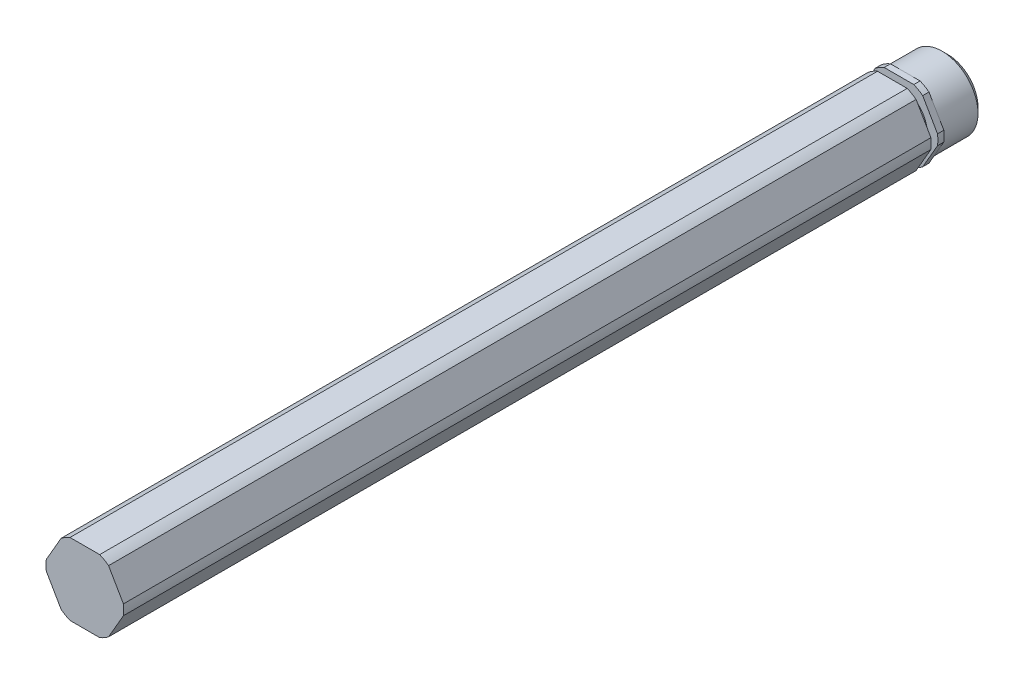
ISO-10303-21;
HEADER;
FILE_DESCRIPTION(('STEP AP214'),'2;1');
FILE_NAME('part.step','',(''),(''),'','','');
FILE_SCHEMA(('AUTOMOTIVE_DESIGN { 1 0 10303 214 1 1 1 1 }'));
ENDSEC;
DATA;
#1=APPLICATION_CONTEXT('core data for automotive mechanical design processes');
#2=APPLICATION_PROTOCOL_DEFINITION('international standard','automotive_design',2000,#1);
#3=PRODUCT_CONTEXT('',#1,'mechanical');
#4=PRODUCT('Part','Part','',(#3));
#5=PRODUCT_RELATED_PRODUCT_CATEGORY('part','',(#4));
#6=PRODUCT_DEFINITION_FORMATION('','',#4);
#7=PRODUCT_DEFINITION_CONTEXT('part definition',#1,'design');
#8=PRODUCT_DEFINITION('design','',#6,#7);
#9=PRODUCT_DEFINITION_SHAPE('','',#8);
#10=(LENGTH_UNIT() NAMED_UNIT(*) SI_UNIT(.MILLI.,.METRE.));
#11=(NAMED_UNIT(*) PLANE_ANGLE_UNIT() SI_UNIT($,.RADIAN.));
#12=(NAMED_UNIT(*) SI_UNIT($,.STERADIAN.) SOLID_ANGLE_UNIT());
#13=UNCERTAINTY_MEASURE_WITH_UNIT(LENGTH_MEASURE(1.E-05),#10,'distance_accuracy_value','');
#14=(GEOMETRIC_REPRESENTATION_CONTEXT(3) GLOBAL_UNCERTAINTY_ASSIGNED_CONTEXT((#13)) GLOBAL_UNIT_ASSIGNED_CONTEXT((#10,
#11,#12)) REPRESENTATION_CONTEXT('',''));
#15=CARTESIAN_POINT('',(0.,0.,0.));
#16=DIRECTION('',(0.,0.,1.));
#17=DIRECTION('',(1.,0.,0.));
#18=AXIS2_PLACEMENT_3D('',#15,#16,#17);
#19=CARTESIAN_POINT('',(7.33234841870824,0.,-76.2));
#20=DIRECTION('',(0.,0.,1.));
#21=DIRECTION('',(1.,0.,0.));
#22=AXIS2_PLACEMENT_3D('',#19,#20,#21);
#23=PLANE('',#22);
#24=CARTESIAN_POINT('',(0.,0.,-76.1999999999716));
#25=DIRECTION('',(0.,0.,1.));
#26=DIRECTION('',(1.,0.,0.));
#27=AXIS2_PLACEMENT_3D('',#24,#25,#26);
#28=CIRCLE('',#27,5.35000000002128);
#29=CARTESIAN_POINT('',(5.35000000002128,0.,-76.1999999999716));
#30=VERTEX_POINT('',#29);
#31=EDGE_CURVE('E20',#30,#30,#28,.T.);
#32=ORIENTED_EDGE('',*,*,#31,.F.);
#33=EDGE_LOOP('',(#32));
#34=FACE_BOUND('',#33,.T.);
#35=ADVANCED_FACE('F17',(#34),#23,.F.);
#36=CARTESIAN_POINT('',(0.,0.,-75.1999999999953));
#37=DIRECTION('',(0.,0.,1.));
#38=DIRECTION('',(1.,0.,0.));
#39=AXIS2_PLACEMENT_3D('',#36,#37,#38);
#40=CONICAL_SURFACE('',#39,6.34999999999764,0.785398163397448);
#41=ORIENTED_EDGE('',*,*,#31,.T.);
#42=EDGE_LOOP('',(#41));
#43=FACE_BOUND('',#42,.T.);
#44=CARTESIAN_POINT('',(0.,0.,-75.2));
#45=DIRECTION('',(0.,0.,-1.));
#46=DIRECTION('',(-1.,0.,0.));
#47=AXIS2_PLACEMENT_3D('',#44,#45,#46);
#48=CIRCLE('',#47,6.35);
#49=CARTESIAN_POINT('',(-6.35,0.,-75.2));
#50=VERTEX_POINT('',#49);
#51=EDGE_CURVE('E216',#50,#50,#48,.F.);
#52=ORIENTED_EDGE('',*,*,#51,.F.);
#53=EDGE_LOOP('',(#52));
#54=FACE_BOUND('',#53,.T.);
#55=ADVANCED_FACE('F797',(#43,#54),#40,.T.);
#56=CARTESIAN_POINT('',(0.,0.,-68.704));
#57=DIRECTION('',(0.,0.,-1.));
#58=DIRECTION('',(-1.,0.,0.));
#59=AXIS2_PLACEMENT_3D('',#56,#57,#58);
#60=CYLINDRICAL_SURFACE('',#59,6.35);
#61=CARTESIAN_POINT('',(0.,0.,-68.704));
#62=DIRECTION('',(0.,0.,-1.));
#63=DIRECTION('',(-1.,0.,0.));
#64=AXIS2_PLACEMENT_3D('',#61,#62,#63);
#65=CIRCLE('',#64,6.35);
#66=CARTESIAN_POINT('',(5.49926131403119,-3.17499999999999,-68.704));
#67=VERTEX_POINT('',#66);
#68=CARTESIAN_POINT('',(5.49926131403118,3.17499999999999,-68.704));
#69=VERTEX_POINT('',#68);
#70=EDGE_CURVE('E191',#67,#69,#65,.F.);
#71=ORIENTED_EDGE('',*,*,#70,.F.);
#72=CARTESIAN_POINT('',(0.,0.,-68.704));
#73=DIRECTION('',(0.,0.,-1.));
#74=DIRECTION('',(-1.,0.,0.));
#75=AXIS2_PLACEMENT_3D('',#72,#73,#74);
#76=CIRCLE('',#75,6.35);
#77=CARTESIAN_POINT('',(0.,-6.35000000000002,-68.704));
#78=VERTEX_POINT('',#77);
#79=EDGE_CURVE('E202',#78,#67,#76,.F.);
#80=ORIENTED_EDGE('',*,*,#79,.F.);
#81=CARTESIAN_POINT('',(0.,0.,-68.704));
#82=DIRECTION('',(0.,0.,-1.));
#83=DIRECTION('',(-1.,0.,0.));
#84=AXIS2_PLACEMENT_3D('',#81,#82,#83);
#85=CIRCLE('',#84,6.35);
#86=CARTESIAN_POINT('',(-5.49926131403119,-3.17500000000001,-68.704));
#87=VERTEX_POINT('',#86);
#88=EDGE_CURVE('E321',#87,#78,#85,.F.);
#89=ORIENTED_EDGE('',*,*,#88,.F.);
#90=CARTESIAN_POINT('',(0.,0.,-68.704));
#91=DIRECTION('',(0.,0.,-1.));
#92=DIRECTION('',(-1.,0.,0.));
#93=AXIS2_PLACEMENT_3D('',#90,#91,#92);
#94=CIRCLE('',#93,6.35);
#95=CARTESIAN_POINT('',(-5.49926131403119,3.175,-68.704));
#96=VERTEX_POINT('',#95);
#97=EDGE_CURVE('E323',#96,#87,#94,.F.);
#98=ORIENTED_EDGE('',*,*,#97,.F.);
#99=CARTESIAN_POINT('',(0.,0.,-68.704));
#100=DIRECTION('',(0.,0.,-1.));
#101=DIRECTION('',(-1.,0.,0.));
#102=AXIS2_PLACEMENT_3D('',#99,#100,#101);
#103=CIRCLE('',#102,6.35);
#104=CARTESIAN_POINT('',(0.,6.35000000000001,-68.704));
#105=VERTEX_POINT('',#104);
#106=EDGE_CURVE('E211',#105,#96,#103,.F.);
#107=ORIENTED_EDGE('',*,*,#106,.F.);
#108=CARTESIAN_POINT('',(0.,0.,-68.704));
#109=DIRECTION('',(0.,0.,-1.));
#110=DIRECTION('',(-1.,0.,0.));
#111=AXIS2_PLACEMENT_3D('',#108,#109,#110);
#112=CIRCLE('',#111,6.35);
#113=EDGE_CURVE('E207',#69,#105,#112,.F.);
#114=ORIENTED_EDGE('',*,*,#113,.F.);
#115=EDGE_LOOP('',(#71,#80,#89,#98,#107,#114));
#116=FACE_BOUND('',#115,.T.);
#117=ORIENTED_EDGE('',*,*,#51,.T.);
#118=EDGE_LOOP('',(#117));
#119=FACE_BOUND('',#118,.T.);
#120=ADVANCED_FACE('F208',(#116,#119),#60,.T.);
#121=CARTESIAN_POINT('',(0.,0.,-68.704));
#122=DIRECTION('',(0.,0.,-1.));
#123=DIRECTION('',(-1.,0.,0.));
#124=AXIS2_PLACEMENT_3D('',#121,#122,#123);
#125=PLANE('',#124);
#126=DIRECTION('',(0.5,-0.866025403784439,0.));
#127=VECTOR('',#126,1.);
#128=CARTESIAN_POINT('',(7.33234841870824,0.,-68.704));
#129=LINE('',#128,#127);
#130=CARTESIAN_POINT('',(4.18830746282205,5.44563867667229,-68.704));
#131=VERTEX_POINT('',#130);
#132=EDGE_CURVE('E220',#131,#69,#129,.T.);
#133=ORIENTED_EDGE('',*,*,#132,.T.);
#134=ORIENTED_EDGE('',*,*,#113,.T.);
#135=DIRECTION('',(1.,0.,0.));
#136=VECTOR('',#135,1.);
#137=CARTESIAN_POINT('',(3.6661742093541,6.35000000000002,-68.704));
#138=LINE('',#137,#136);
#139=CARTESIAN_POINT('',(2.62190770241819,6.35000000000002,-68.704));
#140=VERTEX_POINT('',#139);
#141=EDGE_CURVE('E233',#105,#140,#138,.T.);
#142=ORIENTED_EDGE('',*,*,#141,.T.);
#143=CARTESIAN_POINT('',(0.,0.,-68.704));
#144=DIRECTION('',(0.,0.,1.));
#145=DIRECTION('',(1.,0.,0.));
#146=AXIS2_PLACEMENT_3D('',#143,#144,#145);
#147=CIRCLE('',#146,6.87);
#148=EDGE_CURVE('E228',#131,#140,#147,.T.);
#149=ORIENTED_EDGE('',*,*,#148,.F.);
#150=EDGE_LOOP('',(#133,#134,#142,#149));
#151=FACE_BOUND('',#150,.T.);
#152=ADVANCED_FACE('F227',(#151),#125,.T.);
#153=CARTESIAN_POINT('',(0.,0.,-68.704));
#154=DIRECTION('',(0.,0.,-1.));
#155=DIRECTION('',(-1.,0.,0.));
#156=AXIS2_PLACEMENT_3D('',#153,#154,#155);
#157=PLANE('',#156);
#158=DIRECTION('',(1.,0.,0.));
#159=VECTOR('',#158,1.);
#160=CARTESIAN_POINT('',(3.6661742093541,6.35000000000002,-68.704));
#161=LINE('',#160,#159);
#162=CARTESIAN_POINT('',(-2.62190770241819,6.35000000000002,-68.704));
#163=VERTEX_POINT('',#162);
#164=EDGE_CURVE('E318',#163,#105,#161,.T.);
#165=ORIENTED_EDGE('',*,*,#164,.T.);
#166=ORIENTED_EDGE('',*,*,#106,.T.);
#167=DIRECTION('',(0.5,0.866025403784439,0.));
#168=VECTOR('',#167,1.);
#169=CARTESIAN_POINT('',(-3.66617420935412,6.35000000000002,-68.704));
#170=LINE('',#169,#168);
#171=CARTESIAN_POINT('',(-4.18830746282208,5.44563867667226,-68.704));
#172=VERTEX_POINT('',#171);
#173=EDGE_CURVE('E331',#96,#172,#170,.T.);
#174=ORIENTED_EDGE('',*,*,#173,.T.);
#175=CARTESIAN_POINT('',(0.,0.,-68.704));
#176=DIRECTION('',(0.,0.,1.));
#177=DIRECTION('',(1.,0.,0.));
#178=AXIS2_PLACEMENT_3D('',#175,#176,#177);
#179=CIRCLE('',#178,6.87);
#180=EDGE_CURVE('E314',#163,#172,#179,.T.);
#181=ORIENTED_EDGE('',*,*,#180,.F.);
#182=EDGE_LOOP('',(#165,#166,#174,#181));
#183=FACE_BOUND('',#182,.T.);
#184=ADVANCED_FACE('F329',(#183),#157,.T.);
#185=CARTESIAN_POINT('',(0.,0.,-68.704));
#186=DIRECTION('',(0.,0.,-1.));
#187=DIRECTION('',(-1.,0.,0.));
#188=AXIS2_PLACEMENT_3D('',#185,#186,#187);
#189=PLANE('',#188);
#190=DIRECTION('',(0.5,0.866025403784439,0.));
#191=VECTOR('',#190,1.);
#192=CARTESIAN_POINT('',(-3.66617420935412,6.35000000000002,-68.704));
#193=LINE('',#192,#191);
#194=CARTESIAN_POINT('',(-6.81021516524029,0.904361323327744,-68.704));
#195=VERTEX_POINT('',#194);
#196=EDGE_CURVE('E316',#195,#96,#193,.T.);
#197=ORIENTED_EDGE('',*,*,#196,.T.);
#198=ORIENTED_EDGE('',*,*,#97,.T.);
#199=DIRECTION('',(-0.500000000000001,0.866025403784438,0.));
#200=VECTOR('',#199,1.);
#201=CARTESIAN_POINT('',(-7.33234841870827,0.,-68.704));
#202=LINE('',#201,#200);
#203=CARTESIAN_POINT('',(-6.81021516524029,-0.904361323327794,-68.704));
#204=VERTEX_POINT('',#203);
#205=EDGE_CURVE('E349',#87,#204,#202,.T.);
#206=ORIENTED_EDGE('',*,*,#205,.T.);
#207=CARTESIAN_POINT('',(0.,0.,-68.704));
#208=DIRECTION('',(0.,0.,1.));
#209=DIRECTION('',(1.,0.,0.));
#210=AXIS2_PLACEMENT_3D('',#207,#208,#209);
#211=CIRCLE('',#210,6.87);
#212=EDGE_CURVE('E310',#195,#204,#211,.T.);
#213=ORIENTED_EDGE('',*,*,#212,.F.);
#214=EDGE_LOOP('',(#197,#198,#206,#213));
#215=FACE_BOUND('',#214,.T.);
#216=ADVANCED_FACE('F344',(#215),#189,.T.);
#217=CARTESIAN_POINT('',(0.,0.,-68.704));
#218=DIRECTION('',(0.,0.,-1.));
#219=DIRECTION('',(-1.,0.,0.));
#220=AXIS2_PLACEMENT_3D('',#217,#218,#219);
#221=PLANE('',#220);
#222=DIRECTION('',(-0.500000000000001,0.866025403784438,0.));
#223=VECTOR('',#222,1.);
#224=CARTESIAN_POINT('',(-7.33234841870827,0.,-68.704));
#225=LINE('',#224,#223);
#226=CARTESIAN_POINT('',(-4.18830746282212,-5.44563867667224,-68.704));
#227=VERTEX_POINT('',#226);
#228=EDGE_CURVE('E312',#227,#87,#225,.T.);
#229=ORIENTED_EDGE('',*,*,#228,.T.);
#230=ORIENTED_EDGE('',*,*,#88,.T.);
#231=DIRECTION('',(1.,0.,0.));
#232=VECTOR('',#231,1.);
#233=CARTESIAN_POINT('',(-3.66617420935413,-6.35000000000004,-68.704));
#234=LINE('',#233,#232);
#235=CARTESIAN_POINT('',(-2.62190770241814,-6.35000000000004,-68.704));
#236=VERTEX_POINT('',#235);
#237=EDGE_CURVE('E370',#78,#236,#234,.F.);
#238=ORIENTED_EDGE('',*,*,#237,.T.);
#239=CARTESIAN_POINT('',(0.,0.,-68.704));
#240=DIRECTION('',(0.,0.,1.));
#241=DIRECTION('',(1.,0.,0.));
#242=AXIS2_PLACEMENT_3D('',#239,#240,#241);
#243=CIRCLE('',#242,6.87);
#244=EDGE_CURVE('E306',#227,#236,#243,.T.);
#245=ORIENTED_EDGE('',*,*,#244,.F.);
#246=EDGE_LOOP('',(#229,#230,#238,#245));
#247=FACE_BOUND('',#246,.T.);
#248=ADVANCED_FACE('F761',(#247),#221,.T.);
#249=CARTESIAN_POINT('',(0.,0.,-68.704));
#250=DIRECTION('',(0.,0.,-1.));
#251=DIRECTION('',(-1.,0.,0.));
#252=AXIS2_PLACEMENT_3D('',#249,#250,#251);
#253=PLANE('',#252);
#254=DIRECTION('',(-0.499999999999999,-0.866025403784439,0.));
#255=VECTOR('',#254,1.);
#256=CARTESIAN_POINT('',(3.6661742093541,-6.35000000000004,-68.704));
#257=LINE('',#256,#255);
#258=CARTESIAN_POINT('',(6.8102151652403,-0.904361323327721,-68.704));
#259=VERTEX_POINT('',#258);
#260=EDGE_CURVE('E198',#259,#67,#257,.T.);
#261=ORIENTED_EDGE('',*,*,#260,.T.);
#262=ORIENTED_EDGE('',*,*,#70,.T.);
#263=DIRECTION('',(0.5,-0.866025403784439,0.));
#264=VECTOR('',#263,1.);
#265=CARTESIAN_POINT('',(7.33234841870824,0.,-68.704));
#266=LINE('',#265,#264);
#267=CARTESIAN_POINT('',(6.8102151652403,0.904361323327696,-68.704));
#268=VERTEX_POINT('',#267);
#269=EDGE_CURVE('E195',#69,#268,#266,.T.);
#270=ORIENTED_EDGE('',*,*,#269,.T.);
#271=CARTESIAN_POINT('',(0.,0.,-68.704));
#272=DIRECTION('',(0.,0.,1.));
#273=DIRECTION('',(1.,0.,0.));
#274=AXIS2_PLACEMENT_3D('',#271,#272,#273);
#275=CIRCLE('',#274,6.87);
#276=EDGE_CURVE('E203',#268,#259,#275,.F.);
#277=ORIENTED_EDGE('',*,*,#276,.T.);
#278=EDGE_LOOP('',(#261,#262,#270,#277));
#279=FACE_BOUND('',#278,.T.);
#280=ADVANCED_FACE('F193',(#279),#253,.T.);
#281=CARTESIAN_POINT('',(0.,0.,-68.704));
#282=DIRECTION('',(0.,0.,-1.));
#283=DIRECTION('',(-1.,0.,0.));
#284=AXIS2_PLACEMENT_3D('',#281,#282,#283);
#285=PLANE('',#284);
#286=DIRECTION('',(1.,0.,0.));
#287=VECTOR('',#286,1.);
#288=CARTESIAN_POINT('',(-3.66617420935413,-6.35000000000004,-68.704));
#289=LINE('',#288,#287);
#290=CARTESIAN_POINT('',(2.62190770241814,-6.35000000000004,-68.704));
#291=VERTEX_POINT('',#290);
#292=EDGE_CURVE('E308',#291,#78,#289,.F.);
#293=ORIENTED_EDGE('',*,*,#292,.T.);
#294=ORIENTED_EDGE('',*,*,#79,.T.);
#295=DIRECTION('',(-0.499999999999999,-0.866025403784439,0.));
#296=VECTOR('',#295,1.);
#297=CARTESIAN_POINT('',(3.6661742093541,-6.35000000000004,-68.704));
#298=LINE('',#297,#296);
#299=CARTESIAN_POINT('',(4.18830746282207,-5.44563867667227,-68.704));
#300=VERTEX_POINT('',#299);
#301=EDGE_CURVE('E364',#67,#300,#298,.T.);
#302=ORIENTED_EDGE('',*,*,#301,.T.);
#303=CARTESIAN_POINT('',(0.,0.,-68.704));
#304=DIRECTION('',(0.,0.,1.));
#305=DIRECTION('',(1.,0.,0.));
#306=AXIS2_PLACEMENT_3D('',#303,#304,#305);
#307=CIRCLE('',#306,6.87);
#308=EDGE_CURVE('E303',#291,#300,#307,.T.);
#309=ORIENTED_EDGE('',*,*,#308,.F.);
#310=EDGE_LOOP('',(#293,#294,#302,#309));
#311=FACE_BOUND('',#310,.T.);
#312=ADVANCED_FACE('F745',(#311),#285,.T.);
#313=CARTESIAN_POINT('',(7.33234841870824,0.,76.2));
#314=DIRECTION('',(-0.866025403784439,-0.5,0.));
#315=DIRECTION('',(0.5,-0.866025403784439,0.));
#316=AXIS2_PLACEMENT_3D('',#313,#314,#315);
#317=PLANE('',#316);
#318=ORIENTED_EDGE('',*,*,#269,.F.);
#319=ORIENTED_EDGE('',*,*,#132,.F.);
#320=DIRECTION('',(0.,0.,1.));
#321=VECTOR('',#320,1.);
#322=CARTESIAN_POINT('',(4.18830746282206,5.44563867667228,-76.2));
#323=LINE('',#322,#321);
#324=CARTESIAN_POINT('',(4.18830746282206,5.44563867667228,-67.5924));
#325=VERTEX_POINT('',#324);
#326=EDGE_CURVE('E224',#325,#131,#323,.F.);
#327=ORIENTED_EDGE('',*,*,#326,.F.);
#328=DIRECTION('',(-0.5,0.866025403784439,0.));
#329=VECTOR('',#328,1.);
#330=CARTESIAN_POINT('',(6.8102151652403,0.904361323327701,-67.5924));
#331=LINE('',#330,#329);
#332=CARTESIAN_POINT('',(6.8102151652403,0.9043613233277,-67.5924));
#333=VERTEX_POINT('',#332);
#334=EDGE_CURVE('E302',#333,#325,#331,.T.);
#335=ORIENTED_EDGE('',*,*,#334,.F.);
#336=DIRECTION('',(0.,0.,1.));
#337=VECTOR('',#336,1.);
#338=CARTESIAN_POINT('',(6.8102151652403,0.904361323327697,-76.2));
#339=LINE('',#338,#337);
#340=EDGE_CURVE('E223',#268,#333,#339,.T.);
#341=ORIENTED_EDGE('',*,*,#340,.F.);
#342=EDGE_LOOP('',(#318,#319,#327,#335,#341));
#343=FACE_BOUND('',#342,.T.);
#344=ADVANCED_FACE('F218',(#343),#317,.F.);
#345=CARTESIAN_POINT('',(0.,0.,-76.2));
#346=DIRECTION('',(0.,0.,1.));
#347=DIRECTION('',(1.,0.,0.));
#348=AXIS2_PLACEMENT_3D('',#345,#346,#347);
#349=CYLINDRICAL_SURFACE('',#348,6.87);
#350=ORIENTED_EDGE('',*,*,#326,.T.);
#351=ORIENTED_EDGE('',*,*,#148,.T.);
#352=DIRECTION('',(0.,0.,-1.));
#353=VECTOR('',#352,1.);
#354=CARTESIAN_POINT('',(2.62190770241818,6.35000000000002,76.2));
#355=LINE('',#354,#353);
#356=CARTESIAN_POINT('',(2.62190770241819,6.35000000000002,-67.5924));
#357=VERTEX_POINT('',#356);
#358=EDGE_CURVE('E351',#140,#357,#355,.F.);
#359=ORIENTED_EDGE('',*,*,#358,.T.);
#360=CARTESIAN_POINT('',(0.,0.,-67.5924));
#361=DIRECTION('',(0.,0.,1.));
#362=DIRECTION('',(1.,0.,0.));
#363=AXIS2_PLACEMENT_3D('',#360,#361,#362);
#364=CIRCLE('',#363,6.87);
#365=EDGE_CURVE('E300',#325,#357,#364,.T.);
#366=ORIENTED_EDGE('',*,*,#365,.F.);
#367=EDGE_LOOP('',(#350,#351,#359,#366));
#368=FACE_BOUND('',#367,.T.);
#369=ADVANCED_FACE('F729',(#368),#349,.T.);
#370=CARTESIAN_POINT('',(3.6661742093541,6.35000000000002,76.2));
#371=DIRECTION('',(0.,-1.,0.));
#372=DIRECTION('',(0.,0.,-1.));
#373=AXIS2_PLACEMENT_3D('',#370,#371,#372);
#374=PLANE('',#373);
#375=ORIENTED_EDGE('',*,*,#141,.F.);
#376=ORIENTED_EDGE('',*,*,#164,.F.);
#377=DIRECTION('',(0.,0.,1.));
#378=VECTOR('',#377,1.);
#379=CARTESIAN_POINT('',(-2.62190770241819,6.35000000000002,-76.2));
#380=LINE('',#379,#378);
#381=CARTESIAN_POINT('',(-2.62190770241819,6.35000000000002,-67.5924));
#382=VERTEX_POINT('',#381);
#383=EDGE_CURVE('E317',#382,#163,#380,.F.);
#384=ORIENTED_EDGE('',*,*,#383,.F.);
#385=DIRECTION('',(1.,0.,0.));
#386=VECTOR('',#385,1.);
#387=CARTESIAN_POINT('',(0.,6.35000000000002,-67.5924));
#388=LINE('',#387,#386);
#389=EDGE_CURVE('E299',#357,#382,#388,.F.);
#390=ORIENTED_EDGE('',*,*,#389,.F.);
#391=ORIENTED_EDGE('',*,*,#358,.F.);
#392=EDGE_LOOP('',(#375,#376,#384,#390,#391));
#393=FACE_BOUND('',#392,.T.);
#394=ADVANCED_FACE('F721',(#393),#374,.F.);
#395=CARTESIAN_POINT('',(0.,0.,-76.2));
#396=DIRECTION('',(0.,0.,1.));
#397=DIRECTION('',(1.,0.,0.));
#398=AXIS2_PLACEMENT_3D('',#395,#396,#397);
#399=CYLINDRICAL_SURFACE('',#398,6.87);
#400=ORIENTED_EDGE('',*,*,#383,.T.);
#401=ORIENTED_EDGE('',*,*,#180,.T.);
#402=DIRECTION('',(0.,0.,1.));
#403=VECTOR('',#402,1.);
#404=CARTESIAN_POINT('',(-4.18830746282208,5.44563867667226,76.2));
#405=LINE('',#404,#403);
#406=CARTESIAN_POINT('',(-4.18830746282209,5.44563867667226,-67.5924));
#407=VERTEX_POINT('',#406);
#408=EDGE_CURVE('E340',#172,#407,#405,.T.);
#409=ORIENTED_EDGE('',*,*,#408,.T.);
#410=CARTESIAN_POINT('',(0.,0.,-67.5924));
#411=DIRECTION('',(0.,0.,1.));
#412=DIRECTION('',(1.,0.,0.));
#413=AXIS2_PLACEMENT_3D('',#410,#411,#412);
#414=CIRCLE('',#413,6.87);
#415=EDGE_CURVE('E297',#382,#407,#414,.T.);
#416=ORIENTED_EDGE('',*,*,#415,.F.);
#417=EDGE_LOOP('',(#400,#401,#409,#416));
#418=FACE_BOUND('',#417,.T.);
#419=ADVANCED_FACE('F390',(#418),#399,.T.);
#420=CARTESIAN_POINT('',(-3.66617420935412,6.35000000000002,76.2));
#421=DIRECTION('',(0.866025403784439,-0.5,0.));
#422=DIRECTION('',(0.5,0.866025403784439,0.));
#423=AXIS2_PLACEMENT_3D('',#420,#421,#422);
#424=PLANE('',#423);
#425=ORIENTED_EDGE('',*,*,#173,.F.);
#426=ORIENTED_EDGE('',*,*,#196,.F.);
#427=DIRECTION('',(0.,0.,1.));
#428=VECTOR('',#427,1.);
#429=CARTESIAN_POINT('',(-6.81021516524029,0.904361323327747,-76.2));
#430=LINE('',#429,#428);
#431=CARTESIAN_POINT('',(-6.81021516524029,0.904361323327745,-67.5924));
#432=VERTEX_POINT('',#431);
#433=EDGE_CURVE('E313',#432,#195,#430,.F.);
#434=ORIENTED_EDGE('',*,*,#433,.F.);
#435=DIRECTION('',(-0.5,-0.866025403784439,0.));
#436=VECTOR('',#435,1.);
#437=CARTESIAN_POINT('',(-4.18830746282209,5.44563867667226,-67.5924));
#438=LINE('',#437,#436);
#439=EDGE_CURVE('E296',#407,#432,#438,.T.);
#440=ORIENTED_EDGE('',*,*,#439,.F.);
#441=ORIENTED_EDGE('',*,*,#408,.F.);
#442=EDGE_LOOP('',(#425,#426,#434,#440,#441));
#443=FACE_BOUND('',#442,.T.);
#444=ADVANCED_FACE('F335',(#443),#424,.F.);
#445=CARTESIAN_POINT('',(0.,0.,-76.2));
#446=DIRECTION('',(0.,0.,1.));
#447=DIRECTION('',(1.,0.,0.));
#448=AXIS2_PLACEMENT_3D('',#445,#446,#447);
#449=CYLINDRICAL_SURFACE('',#448,6.87);
#450=ORIENTED_EDGE('',*,*,#433,.T.);
#451=ORIENTED_EDGE('',*,*,#212,.T.);
#452=DIRECTION('',(0.,0.,1.));
#453=VECTOR('',#452,1.);
#454=CARTESIAN_POINT('',(-6.81021516524029,-0.904361323327795,76.2));
#455=LINE('',#454,#453);
#456=CARTESIAN_POINT('',(-6.81021516524029,-0.904361323327794,-67.5924));
#457=VERTEX_POINT('',#456);
#458=EDGE_CURVE('E376',#204,#457,#455,.T.);
#459=ORIENTED_EDGE('',*,*,#458,.T.);
#460=CARTESIAN_POINT('',(0.,0.,-67.5924));
#461=DIRECTION('',(0.,0.,1.));
#462=DIRECTION('',(1.,0.,0.));
#463=AXIS2_PLACEMENT_3D('',#460,#461,#462);
#464=CIRCLE('',#463,6.87);
#465=EDGE_CURVE('E294',#432,#457,#464,.T.);
#466=ORIENTED_EDGE('',*,*,#465,.F.);
#467=EDGE_LOOP('',(#450,#451,#459,#466));
#468=FACE_BOUND('',#467,.T.);
#469=ADVANCED_FACE('F698',(#468),#449,.T.);
#470=CARTESIAN_POINT('',(-7.33234841870827,0.,76.2));
#471=DIRECTION('',(0.866025403784438,0.500000000000001,0.));
#472=DIRECTION('',(-0.500000000000001,0.866025403784438,0.));
#473=AXIS2_PLACEMENT_3D('',#470,#471,#472);
#474=PLANE('',#473);
#475=ORIENTED_EDGE('',*,*,#205,.F.);
#476=ORIENTED_EDGE('',*,*,#228,.F.);
#477=DIRECTION('',(0.,0.,1.));
#478=VECTOR('',#477,1.);
#479=CARTESIAN_POINT('',(-4.18830746282212,-5.44563867667223,-76.2));
#480=LINE('',#479,#478);
#481=CARTESIAN_POINT('',(-4.18830746282212,-5.44563867667224,-67.5924));
#482=VERTEX_POINT('',#481);
#483=EDGE_CURVE('E309',#482,#227,#480,.F.);
#484=ORIENTED_EDGE('',*,*,#483,.F.);
#485=DIRECTION('',(0.5,-0.866025403784438,0.));
#486=VECTOR('',#485,1.);
#487=CARTESIAN_POINT('',(-6.81021516524029,-0.904361323327798,-67.5924));
#488=LINE('',#487,#486);
#489=EDGE_CURVE('E293',#457,#482,#488,.T.);
#490=ORIENTED_EDGE('',*,*,#489,.F.);
#491=ORIENTED_EDGE('',*,*,#458,.F.);
#492=EDGE_LOOP('',(#475,#476,#484,#490,#491));
#493=FACE_BOUND('',#492,.T.);
#494=ADVANCED_FACE('F690',(#493),#474,.F.);
#495=CARTESIAN_POINT('',(0.,0.,-76.2));
#496=DIRECTION('',(0.,0.,1.));
#497=DIRECTION('',(1.,0.,0.));
#498=AXIS2_PLACEMENT_3D('',#495,#496,#497);
#499=CYLINDRICAL_SURFACE('',#498,6.87);
#500=ORIENTED_EDGE('',*,*,#483,.T.);
#501=ORIENTED_EDGE('',*,*,#244,.T.);
#502=DIRECTION('',(0.,0.,1.));
#503=VECTOR('',#502,1.);
#504=CARTESIAN_POINT('',(-2.62190770241814,-6.35000000000004,76.2));
#505=LINE('',#504,#503);
#506=CARTESIAN_POINT('',(-2.62190770241814,-6.35000000000004,-67.5924));
#507=VERTEX_POINT('',#506);
#508=EDGE_CURVE('E372',#236,#507,#505,.T.);
#509=ORIENTED_EDGE('',*,*,#508,.T.);
#510=CARTESIAN_POINT('',(0.,0.,-67.5924));
#511=DIRECTION('',(0.,0.,1.));
#512=DIRECTION('',(1.,0.,0.));
#513=AXIS2_PLACEMENT_3D('',#510,#511,#512);
#514=CIRCLE('',#513,6.87);
#515=EDGE_CURVE('E291',#482,#507,#514,.T.);
#516=ORIENTED_EDGE('',*,*,#515,.F.);
#517=EDGE_LOOP('',(#500,#501,#509,#516));
#518=FACE_BOUND('',#517,.T.);
#519=ADVANCED_FACE('F410',(#518),#499,.T.);
#520=CARTESIAN_POINT('',(-3.66617420935413,-6.35000000000004,76.2));
#521=DIRECTION('',(0.,1.,0.));
#522=DIRECTION('',(0.,0.,1.));
#523=AXIS2_PLACEMENT_3D('',#520,#521,#522);
#524=PLANE('',#523);
#525=ORIENTED_EDGE('',*,*,#237,.F.);
#526=ORIENTED_EDGE('',*,*,#292,.F.);
#527=DIRECTION('',(0.,0.,1.));
#528=VECTOR('',#527,1.);
#529=CARTESIAN_POINT('',(2.62190770241814,-6.35000000000004,-76.2));
#530=LINE('',#529,#528);
#531=CARTESIAN_POINT('',(2.62190770241814,-6.35000000000004,-67.5924));
#532=VERTEX_POINT('',#531);
#533=EDGE_CURVE('E305',#532,#291,#530,.F.);
#534=ORIENTED_EDGE('',*,*,#533,.F.);
#535=DIRECTION('',(1.,0.,0.));
#536=VECTOR('',#535,1.);
#537=CARTESIAN_POINT('',(0.,-6.35000000000004,-67.5924));
#538=LINE('',#537,#536);
#539=EDGE_CURVE('E290',#507,#532,#538,.T.);
#540=ORIENTED_EDGE('',*,*,#539,.F.);
#541=ORIENTED_EDGE('',*,*,#508,.F.);
#542=EDGE_LOOP('',(#525,#526,#534,#540,#541));
#543=FACE_BOUND('',#542,.T.);
#544=ADVANCED_FACE('F414',(#543),#524,.F.);
#545=CARTESIAN_POINT('',(0.,0.,-76.2));
#546=DIRECTION('',(0.,0.,1.));
#547=DIRECTION('',(1.,0.,0.));
#548=AXIS2_PLACEMENT_3D('',#545,#546,#547);
#549=CYLINDRICAL_SURFACE('',#548,6.87);
#550=ORIENTED_EDGE('',*,*,#533,.T.);
#551=ORIENTED_EDGE('',*,*,#308,.T.);
#552=DIRECTION('',(0.,0.,1.));
#553=VECTOR('',#552,1.);
#554=CARTESIAN_POINT('',(4.18830746282208,-5.44563867667227,76.2));
#555=LINE('',#554,#553);
#556=CARTESIAN_POINT('',(4.18830746282208,-5.44563867667227,-67.5924));
#557=VERTEX_POINT('',#556);
#558=EDGE_CURVE('E367',#300,#557,#555,.T.);
#559=ORIENTED_EDGE('',*,*,#558,.T.);
#560=CARTESIAN_POINT('',(0.,0.,-67.5924));
#561=DIRECTION('',(0.,0.,1.));
#562=DIRECTION('',(1.,0.,0.));
#563=AXIS2_PLACEMENT_3D('',#560,#561,#562);
#564=CIRCLE('',#563,6.87);
#565=EDGE_CURVE('E288',#532,#557,#564,.T.);
#566=ORIENTED_EDGE('',*,*,#565,.F.);
#567=EDGE_LOOP('',(#550,#551,#559,#566));
#568=FACE_BOUND('',#567,.T.);
#569=ADVANCED_FACE('F666',(#568),#549,.T.);
#570=CARTESIAN_POINT('',(3.6661742093541,-6.35000000000004,76.2));
#571=DIRECTION('',(-0.866025403784439,0.499999999999999,0.));
#572=DIRECTION('',(-0.499999999999999,-0.866025403784439,0.));
#573=AXIS2_PLACEMENT_3D('',#570,#571,#572);
#574=PLANE('',#573);
#575=ORIENTED_EDGE('',*,*,#301,.F.);
#576=ORIENTED_EDGE('',*,*,#260,.F.);
#577=DIRECTION('',(0.,0.,1.));
#578=VECTOR('',#577,1.);
#579=CARTESIAN_POINT('',(6.8102151652403,-0.904361323327727,-76.2));
#580=LINE('',#579,#578);
#581=CARTESIAN_POINT('',(6.8102151652403,-0.904361323327724,-67.5924));
#582=VERTEX_POINT('',#581);
#583=EDGE_CURVE('E399',#582,#259,#580,.F.);
#584=ORIENTED_EDGE('',*,*,#583,.F.);
#585=DIRECTION('',(0.499999999999999,0.866025403784439,0.));
#586=VECTOR('',#585,1.);
#587=CARTESIAN_POINT('',(4.18830746282208,-5.44563867667227,-67.5924));
#588=LINE('',#587,#586);
#589=EDGE_CURVE('E287',#557,#582,#588,.T.);
#590=ORIENTED_EDGE('',*,*,#589,.F.);
#591=ORIENTED_EDGE('',*,*,#558,.F.);
#592=EDGE_LOOP('',(#575,#576,#584,#590,#591));
#593=FACE_BOUND('',#592,.T.);
#594=ADVANCED_FACE('F657',(#593),#574,.F.);
#595=CARTESIAN_POINT('',(0.,0.,-76.2));
#596=DIRECTION('',(0.,0.,1.));
#597=DIRECTION('',(1.,0.,0.));
#598=AXIS2_PLACEMENT_3D('',#595,#596,#597);
#599=CYLINDRICAL_SURFACE('',#598,6.87);
#600=ORIENTED_EDGE('',*,*,#340,.T.);
#601=CARTESIAN_POINT('',(0.,0.,-67.5924));
#602=DIRECTION('',(0.,0.,1.));
#603=DIRECTION('',(1.,0.,0.));
#604=AXIS2_PLACEMENT_3D('',#601,#602,#603);
#605=CIRCLE('',#604,6.87);
#606=EDGE_CURVE('E284',#582,#333,#605,.T.);
#607=ORIENTED_EDGE('',*,*,#606,.F.);
#608=ORIENTED_EDGE('',*,*,#583,.T.);
#609=ORIENTED_EDGE('',*,*,#276,.F.);
#610=EDGE_LOOP('',(#600,#607,#608,#609));
#611=FACE_BOUND('',#610,.T.);
#612=ADVANCED_FACE('F649',(#611),#599,.T.);
#613=CARTESIAN_POINT('',(0.,9.67349289505185,-67.5924));
#614=DIRECTION('',(0.,0.,1.));
#615=DIRECTION('',(1.,0.,0.));
#616=AXIS2_PLACEMENT_3D('',#613,#614,#615);
#617=PLANE('',#616);
#618=ORIENTED_EDGE('',*,*,#589,.T.);
#619=ORIENTED_EDGE('',*,*,#606,.T.);
#620=ORIENTED_EDGE('',*,*,#334,.T.);
#621=ORIENTED_EDGE('',*,*,#365,.T.);
#622=ORIENTED_EDGE('',*,*,#389,.T.);
#623=ORIENTED_EDGE('',*,*,#415,.T.);
#624=ORIENTED_EDGE('',*,*,#439,.T.);
#625=ORIENTED_EDGE('',*,*,#465,.T.);
#626=ORIENTED_EDGE('',*,*,#489,.T.);
#627=ORIENTED_EDGE('',*,*,#515,.T.);
#628=ORIENTED_EDGE('',*,*,#539,.T.);
#629=ORIENTED_EDGE('',*,*,#565,.T.);
#630=EDGE_LOOP('',(#618,#619,#620,#621,#622,#623,#624,#625,#626,#627,#628,#629));
#631=FACE_BOUND('',#630,.T.);
#632=CARTESIAN_POINT('',(0.,0.,-67.5924));
#633=DIRECTION('',(0.,0.,1.));
#634=DIRECTION('',(1.,0.,0.));
#635=AXIS2_PLACEMENT_3D('',#632,#633,#634);
#636=CIRCLE('',#635,5.0292);
#637=CARTESIAN_POINT('',(5.0292,0.,-67.5924));
#638=VERTEX_POINT('',#637);
#639=EDGE_CURVE('E280',#638,#638,#636,.T.);
#640=ORIENTED_EDGE('',*,*,#639,.F.);
#641=EDGE_LOOP('',(#640));
#642=FACE_BOUND('',#641,.T.);
#643=ADVANCED_FACE('F640',(#631,#642),#617,.T.);
#644=CARTESIAN_POINT('',(0.,0.,-56.8163271417919));
#645=DIRECTION('',(0.,0.,1.));
#646=DIRECTION('',(1.,0.,0.));
#647=AXIS2_PLACEMENT_3D('',#644,#645,#646);
#648=CYLINDRICAL_SURFACE('',#647,5.0292);
#649=ORIENTED_EDGE('',*,*,#639,.T.);
#650=EDGE_LOOP('',(#649));
#651=FACE_BOUND('',#650,.T.);
#652=CARTESIAN_POINT('',(0.,0.,-66.424));
#653=DIRECTION('',(0.,0.,1.));
#654=DIRECTION('',(1.,0.,0.));
#655=AXIS2_PLACEMENT_3D('',#652,#653,#654);
#656=CIRCLE('',#655,5.0292);
#657=CARTESIAN_POINT('',(5.0292,0.,-66.424));
#658=VERTEX_POINT('',#657);
#659=EDGE_CURVE('E257',#658,#658,#656,.T.);
#660=ORIENTED_EDGE('',*,*,#659,.F.);
#661=EDGE_LOOP('',(#660));
#662=FACE_BOUND('',#661,.T.);
#663=ADVANCED_FACE('F632',(#651,#662),#648,.T.);
#664=CARTESIAN_POINT('',(-3.66617420935412,6.35000000000002,76.2));
#665=DIRECTION('',(0.866025403784439,-0.5,0.));
#666=DIRECTION('',(0.5,0.866025403784439,0.));
#667=AXIS2_PLACEMENT_3D('',#664,#665,#666);
#668=PLANE('',#667);
#669=DIRECTION('',(0.499999999999999,0.866025403784439,0.));
#670=VECTOR('',#669,1.);
#671=CARTESIAN_POINT('',(-6.81021516524029,0.904361323327741,-66.424));
#672=LINE('',#671,#670);
#673=CARTESIAN_POINT('',(-6.8102151652403,0.90436132332774,-66.424));
#674=VERTEX_POINT('',#673);
#675=CARTESIAN_POINT('',(-4.18830746282209,5.44563867667226,-66.424));
#676=VERTEX_POINT('',#675);
#677=EDGE_CURVE('E256',#674,#676,#672,.T.);
#678=ORIENTED_EDGE('',*,*,#677,.F.);
#679=DIRECTION('',(0.,0.,1.));
#680=VECTOR('',#679,1.);
#681=CARTESIAN_POINT('',(-6.8102151652403,0.904361323327741,-76.2));
#682=LINE('',#681,#680);
#683=CARTESIAN_POINT('',(-6.8102151652403,0.90436132332774,76.2));
#684=VERTEX_POINT('',#683);
#685=EDGE_CURVE('E427',#684,#674,#682,.F.);
#686=ORIENTED_EDGE('',*,*,#685,.F.);
#687=DIRECTION('',(-0.5,-0.866025403784439,0.));
#688=VECTOR('',#687,1.);
#689=CARTESIAN_POINT('',(-4.18830746282208,5.44563867667226,76.2));
#690=LINE('',#689,#688);
#691=CARTESIAN_POINT('',(-4.18830746282209,5.44563867667226,76.2));
#692=VERTEX_POINT('',#691);
#693=EDGE_CURVE('E275',#692,#684,#690,.T.);
#694=ORIENTED_EDGE('',*,*,#693,.F.);
#695=DIRECTION('',(0.,0.,1.));
#696=VECTOR('',#695,1.);
#697=CARTESIAN_POINT('',(-4.18830746282209,5.44563867667226,-76.2));
#698=LINE('',#697,#696);
#699=EDGE_CURVE('E283',#676,#692,#698,.T.);
#700=ORIENTED_EDGE('',*,*,#699,.F.);
#701=EDGE_LOOP('',(#678,#686,#694,#700));
#702=FACE_BOUND('',#701,.T.);
#703=ADVANCED_FACE('F477',(#702),#668,.F.);
#704=CARTESIAN_POINT('',(0.,0.,-76.2));
#705=DIRECTION('',(0.,0.,1.));
#706=DIRECTION('',(1.,0.,0.));
#707=AXIS2_PLACEMENT_3D('',#704,#705,#706);
#708=CYLINDRICAL_SURFACE('',#707,6.87);
#709=DIRECTION('',(0.,0.,-1.));
#710=VECTOR('',#709,1.);
#711=CARTESIAN_POINT('',(-2.62190770241818,6.35000000000002,76.2));
#712=LINE('',#711,#710);
#713=CARTESIAN_POINT('',(-2.62190770241818,6.35000000000002,76.2));
#714=VERTEX_POINT('',#713);
#715=CARTESIAN_POINT('',(-2.62190770241819,6.35000000000002,-66.424));
#716=VERTEX_POINT('',#715);
#717=EDGE_CURVE('E420',#714,#716,#712,.T.);
#718=ORIENTED_EDGE('',*,*,#717,.T.);
#719=CARTESIAN_POINT('',(0.,0.,-66.424));
#720=DIRECTION('',(0.,0.,1.));
#721=DIRECTION('',(1.,0.,0.));
#722=AXIS2_PLACEMENT_3D('',#719,#720,#721);
#723=CIRCLE('',#722,6.87);
#724=EDGE_CURVE('E254',#676,#716,#723,.F.);
#725=ORIENTED_EDGE('',*,*,#724,.F.);
#726=ORIENTED_EDGE('',*,*,#699,.T.);
#727=CARTESIAN_POINT('',(0.,0.,76.2));
#728=DIRECTION('',(0.,0.,1.));
#729=DIRECTION('',(1.,0.,0.));
#730=AXIS2_PLACEMENT_3D('',#727,#728,#729);
#731=CIRCLE('',#730,6.87);
#732=EDGE_CURVE('E276',#714,#692,#731,.T.);
#733=ORIENTED_EDGE('',*,*,#732,.F.);
#734=EDGE_LOOP('',(#718,#725,#726,#733));
#735=FACE_BOUND('',#734,.T.);
#736=ADVANCED_FACE('F484',(#735),#708,.T.);
#737=CARTESIAN_POINT('',(3.6661742093541,6.35000000000002,76.2));
#738=DIRECTION('',(0.,-1.,0.));
#739=DIRECTION('',(0.,0.,-1.));
#740=AXIS2_PLACEMENT_3D('',#737,#738,#739);
#741=PLANE('',#740);
#742=DIRECTION('',(-1.,0.,0.));
#743=VECTOR('',#742,1.);
#744=CARTESIAN_POINT('',(0.,6.35000000000002,-66.424));
#745=LINE('',#744,#743);
#746=CARTESIAN_POINT('',(2.62190770241819,6.35000000000002,-66.424));
#747=VERTEX_POINT('',#746);
#748=EDGE_CURVE('E253',#716,#747,#745,.F.);
#749=ORIENTED_EDGE('',*,*,#748,.F.);
#750=ORIENTED_EDGE('',*,*,#717,.F.);
#751=DIRECTION('',(1.,0.,0.));
#752=VECTOR('',#751,1.);
#753=CARTESIAN_POINT('',(7.33234841870824,6.35000000000002,76.2));
#754=LINE('',#753,#752);
#755=CARTESIAN_POINT('',(2.62190770241819,6.35000000000002,76.2));
#756=VERTEX_POINT('',#755);
#757=EDGE_CURVE('E279',#756,#714,#754,.F.);
#758=ORIENTED_EDGE('',*,*,#757,.F.);
#759=DIRECTION('',(0.,0.,1.));
#760=VECTOR('',#759,1.);
#761=CARTESIAN_POINT('',(2.62190770241818,6.35000000000002,-76.2));
#762=LINE('',#761,#760);
#763=EDGE_CURVE('E262',#747,#756,#762,.T.);
#764=ORIENTED_EDGE('',*,*,#763,.F.);
#765=EDGE_LOOP('',(#749,#750,#758,#764));
#766=FACE_BOUND('',#765,.T.);
#767=ADVANCED_FACE('F487',(#766),#741,.F.);
#768=CARTESIAN_POINT('',(3.6661742093541,-6.35000000000004,76.2));
#769=DIRECTION('',(-0.866025403784439,0.499999999999999,0.));
#770=DIRECTION('',(-0.499999999999999,-0.866025403784439,0.));
#771=AXIS2_PLACEMENT_3D('',#768,#769,#770);
#772=PLANE('',#771);
#773=DIRECTION('',(-0.499999999999999,-0.866025403784439,0.));
#774=VECTOR('',#773,1.);
#775=CARTESIAN_POINT('',(6.8102151652403,-0.904361323327716,-66.424));
#776=LINE('',#775,#774);
#777=CARTESIAN_POINT('',(6.8102151652403,-0.904361323327718,-66.424));
#778=VERTEX_POINT('',#777);
#779=CARTESIAN_POINT('',(4.18830746282207,-5.44563867667227,-66.424));
#780=VERTEX_POINT('',#779);
#781=EDGE_CURVE('E250',#778,#780,#776,.T.);
#782=ORIENTED_EDGE('',*,*,#781,.F.);
#783=DIRECTION('',(0.,0.,1.));
#784=VECTOR('',#783,1.);
#785=CARTESIAN_POINT('',(6.8102151652403,-0.904361323327721,-76.2));
#786=LINE('',#785,#784);
#787=CARTESIAN_POINT('',(6.8102151652403,-0.904361323327719,76.2));
#788=VERTEX_POINT('',#787);
#789=EDGE_CURVE('E425',#788,#778,#786,.F.);
#790=ORIENTED_EDGE('',*,*,#789,.F.);
#791=DIRECTION('',(0.499999999999999,0.866025403784439,0.));
#792=VECTOR('',#791,1.);
#793=CARTESIAN_POINT('',(4.18830746282207,-5.44563867667227,76.2));
#794=LINE('',#793,#792);
#795=CARTESIAN_POINT('',(4.18830746282207,-5.44563867667227,76.2));
#796=VERTEX_POINT('',#795);
#797=EDGE_CURVE('E266',#796,#788,#794,.T.);
#798=ORIENTED_EDGE('',*,*,#797,.F.);
#799=DIRECTION('',(0.,0.,1.));
#800=VECTOR('',#799,1.);
#801=CARTESIAN_POINT('',(4.18830746282207,-5.44563867667227,-76.2));
#802=LINE('',#801,#800);
#803=EDGE_CURVE('E423',#780,#796,#802,.T.);
#804=ORIENTED_EDGE('',*,*,#803,.F.);
#805=EDGE_LOOP('',(#782,#790,#798,#804));
#806=FACE_BOUND('',#805,.T.);
#807=ADVANCED_FACE('F507',(#806),#772,.F.);
#808=CARTESIAN_POINT('',(0.,0.,-76.2));
#809=DIRECTION('',(0.,0.,1.));
#810=DIRECTION('',(1.,0.,0.));
#811=AXIS2_PLACEMENT_3D('',#808,#809,#810);
#812=CYLINDRICAL_SURFACE('',#811,6.87);
#813=ORIENTED_EDGE('',*,*,#803,.T.);
#814=CARTESIAN_POINT('',(0.,0.,76.2));
#815=DIRECTION('',(0.,0.,1.));
#816=DIRECTION('',(1.,0.,0.));
#817=AXIS2_PLACEMENT_3D('',#814,#815,#816);
#818=CIRCLE('',#817,6.87);
#819=CARTESIAN_POINT('',(2.62190770241814,-6.35000000000004,76.2));
#820=VERTEX_POINT('',#819);
#821=EDGE_CURVE('E263',#820,#796,#818,.T.);
#822=ORIENTED_EDGE('',*,*,#821,.F.);
#823=DIRECTION('',(0.,0.,1.));
#824=VECTOR('',#823,1.);
#825=CARTESIAN_POINT('',(2.62190770241814,-6.35000000000004,76.2));
#826=LINE('',#825,#824);
#827=CARTESIAN_POINT('',(2.62190770241814,-6.35000000000004,-66.424));
#828=VERTEX_POINT('',#827);
#829=EDGE_CURVE('E429',#820,#828,#826,.F.);
#830=ORIENTED_EDGE('',*,*,#829,.T.);
#831=CARTESIAN_POINT('',(0.,0.,-66.424));
#832=DIRECTION('',(0.,0.,1.));
#833=DIRECTION('',(1.,0.,0.));
#834=AXIS2_PLACEMENT_3D('',#831,#832,#833);
#835=CIRCLE('',#834,6.87);
#836=EDGE_CURVE('E248',#780,#828,#835,.F.);
#837=ORIENTED_EDGE('',*,*,#836,.F.);
#838=EDGE_LOOP('',(#813,#822,#830,#837));
#839=FACE_BOUND('',#838,.T.);
#840=ADVANCED_FACE('F512',(#839),#812,.T.);
#841=CARTESIAN_POINT('',(-3.66617420935413,-6.35000000000004,76.2));
#842=DIRECTION('',(0.,1.,0.));
#843=DIRECTION('',(0.,0.,1.));
#844=AXIS2_PLACEMENT_3D('',#841,#842,#843);
#845=PLANE('',#844);
#846=DIRECTION('',(-1.,0.,0.));
#847=VECTOR('',#846,1.);
#848=CARTESIAN_POINT('',(0.,-6.35000000000004,-66.424));
#849=LINE('',#848,#847);
#850=CARTESIAN_POINT('',(-2.62190770241814,-6.35000000000004,-66.424));
#851=VERTEX_POINT('',#850);
#852=EDGE_CURVE('E247',#828,#851,#849,.T.);
#853=ORIENTED_EDGE('',*,*,#852,.F.);
#854=ORIENTED_EDGE('',*,*,#829,.F.);
#855=DIRECTION('',(1.,0.,0.));
#856=VECTOR('',#855,1.);
#857=CARTESIAN_POINT('',(7.33234841870824,-6.35000000000004,76.2));
#858=LINE('',#857,#856);
#859=CARTESIAN_POINT('',(-2.62190770241814,-6.35000000000004,76.2));
#860=VERTEX_POINT('',#859);
#861=EDGE_CURVE('E267',#860,#820,#858,.T.);
#862=ORIENTED_EDGE('',*,*,#861,.F.);
#863=DIRECTION('',(0.,0.,1.));
#864=VECTOR('',#863,1.);
#865=CARTESIAN_POINT('',(-2.62190770241814,-6.35000000000004,-76.2));
#866=LINE('',#865,#864);
#867=EDGE_CURVE('E432',#851,#860,#866,.T.);
#868=ORIENTED_EDGE('',*,*,#867,.F.);
#869=EDGE_LOOP('',(#853,#854,#862,#868));
#870=FACE_BOUND('',#869,.T.);
#871=ADVANCED_FACE('F515',(#870),#845,.F.);
#872=CARTESIAN_POINT('',(0.,0.,-76.2));
#873=DIRECTION('',(0.,0.,1.));
#874=DIRECTION('',(1.,0.,0.));
#875=AXIS2_PLACEMENT_3D('',#872,#873,#874);
#876=CYLINDRICAL_SURFACE('',#875,6.87);
#877=DIRECTION('',(0.,0.,1.));
#878=VECTOR('',#877,1.);
#879=CARTESIAN_POINT('',(-4.18830746282212,-5.44563867667223,76.2));
#880=LINE('',#879,#878);
#881=CARTESIAN_POINT('',(-4.18830746282212,-5.44563867667224,76.2));
#882=VERTEX_POINT('',#881);
#883=CARTESIAN_POINT('',(-4.18830746282212,-5.44563867667224,-66.424));
#884=VERTEX_POINT('',#883);
#885=EDGE_CURVE('E434',#882,#884,#880,.F.);
#886=ORIENTED_EDGE('',*,*,#885,.T.);
#887=CARTESIAN_POINT('',(0.,0.,-66.424));
#888=DIRECTION('',(0.,0.,1.));
#889=DIRECTION('',(1.,0.,0.));
#890=AXIS2_PLACEMENT_3D('',#887,#888,#889);
#891=CIRCLE('',#890,6.87);
#892=EDGE_CURVE('E245',#851,#884,#891,.F.);
#893=ORIENTED_EDGE('',*,*,#892,.F.);
#894=ORIENTED_EDGE('',*,*,#867,.T.);
#895=CARTESIAN_POINT('',(0.,0.,76.2));
#896=DIRECTION('',(0.,0.,1.));
#897=DIRECTION('',(1.,0.,0.));
#898=AXIS2_PLACEMENT_3D('',#895,#896,#897);
#899=CIRCLE('',#898,6.87);
#900=EDGE_CURVE('E268',#882,#860,#899,.T.);
#901=ORIENTED_EDGE('',*,*,#900,.F.);
#902=EDGE_LOOP('',(#886,#893,#894,#901));
#903=FACE_BOUND('',#902,.T.);
#904=ADVANCED_FACE('F518',(#903),#876,.T.);
#905=CARTESIAN_POINT('',(-7.33234841870827,0.,76.2));
#906=DIRECTION('',(0.866025403784438,0.500000000000001,0.));
#907=DIRECTION('',(-0.500000000000001,0.866025403784438,0.));
#908=AXIS2_PLACEMENT_3D('',#905,#906,#907);
#909=PLANE('',#908);
#910=DIRECTION('',(-0.500000000000001,0.866025403784438,0.));
#911=VECTOR('',#910,1.);
#912=CARTESIAN_POINT('',(-4.18830746282212,-5.44563867667224,-66.424));
#913=LINE('',#912,#911);
#914=CARTESIAN_POINT('',(-6.81021516524029,-0.904361323327797,-66.424));
#915=VERTEX_POINT('',#914);
#916=EDGE_CURVE('E244',#884,#915,#913,.T.);
#917=ORIENTED_EDGE('',*,*,#916,.F.);
#918=ORIENTED_EDGE('',*,*,#885,.F.);
#919=DIRECTION('',(0.500000000000001,-0.866025403784438,0.));
#920=VECTOR('',#919,1.);
#921=CARTESIAN_POINT('',(-6.81021516524029,-0.904361323327795,76.2));
#922=LINE('',#921,#920);
#923=CARTESIAN_POINT('',(-6.81021516524029,-0.904361323327797,76.2));
#924=VERTEX_POINT('',#923);
#925=EDGE_CURVE('E271',#924,#882,#922,.T.);
#926=ORIENTED_EDGE('',*,*,#925,.F.);
#927=DIRECTION('',(0.,0.,1.));
#928=VECTOR('',#927,1.);
#929=CARTESIAN_POINT('',(-6.81021516524029,-0.904361323327797,-76.2));
#930=LINE('',#929,#928);
#931=EDGE_CURVE('E437',#915,#924,#930,.T.);
#932=ORIENTED_EDGE('',*,*,#931,.F.);
#933=EDGE_LOOP('',(#917,#918,#926,#932));
#934=FACE_BOUND('',#933,.T.);
#935=ADVANCED_FACE('F470',(#934),#909,.F.);
#936=CARTESIAN_POINT('',(0.,0.,-76.2));
#937=DIRECTION('',(0.,0.,1.));
#938=DIRECTION('',(1.,0.,0.));
#939=AXIS2_PLACEMENT_3D('',#936,#937,#938);
#940=CYLINDRICAL_SURFACE('',#939,6.87);
#941=ORIENTED_EDGE('',*,*,#685,.T.);
#942=CARTESIAN_POINT('',(0.,0.,-66.424));
#943=DIRECTION('',(0.,0.,1.));
#944=DIRECTION('',(1.,0.,0.));
#945=AXIS2_PLACEMENT_3D('',#942,#943,#944);
#946=CIRCLE('',#945,6.87);
#947=EDGE_CURVE('E241',#915,#674,#946,.F.);
#948=ORIENTED_EDGE('',*,*,#947,.F.);
#949=ORIENTED_EDGE('',*,*,#931,.T.);
#950=CARTESIAN_POINT('',(0.,0.,76.2));
#951=DIRECTION('',(0.,0.,1.));
#952=DIRECTION('',(1.,0.,0.));
#953=AXIS2_PLACEMENT_3D('',#950,#951,#952);
#954=CIRCLE('',#953,6.87);
#955=EDGE_CURVE('E272',#684,#924,#954,.T.);
#956=ORIENTED_EDGE('',*,*,#955,.F.);
#957=EDGE_LOOP('',(#941,#948,#949,#956));
#958=FACE_BOUND('',#957,.T.);
#959=ADVANCED_FACE('F473',(#958),#940,.T.);
#960=CARTESIAN_POINT('',(7.33234841870824,0.,76.2));
#961=DIRECTION('',(0.,0.,1.));
#962=DIRECTION('',(1.,0.,0.));
#963=AXIS2_PLACEMENT_3D('',#960,#961,#962);
#964=PLANE('',#963);
#965=ORIENTED_EDGE('',*,*,#797,.T.);
#966=CARTESIAN_POINT('',(0.,0.,76.2));
#967=DIRECTION('',(0.,0.,1.));
#968=DIRECTION('',(1.,0.,0.));
#969=AXIS2_PLACEMENT_3D('',#966,#967,#968);
#970=CIRCLE('',#969,6.87);
#971=CARTESIAN_POINT('',(6.8102151652403,0.904361323327697,76.2));
#972=VERTEX_POINT('',#971);
#973=EDGE_CURVE('E237',#972,#788,#970,.F.);
#974=ORIENTED_EDGE('',*,*,#973,.F.);
#975=DIRECTION('',(0.5,-0.866025403784439,0.));
#976=VECTOR('',#975,1.);
#977=CARTESIAN_POINT('',(7.33234841870824,0.,76.2));
#978=LINE('',#977,#976);
#979=CARTESIAN_POINT('',(4.18830746282205,5.44563867667229,76.2));
#980=VERTEX_POINT('',#979);
#981=EDGE_CURVE('E239',#972,#980,#978,.F.);
#982=ORIENTED_EDGE('',*,*,#981,.T.);
#983=CARTESIAN_POINT('',(0.,0.,76.2));
#984=DIRECTION('',(0.,0.,1.));
#985=DIRECTION('',(1.,0.,0.));
#986=AXIS2_PLACEMENT_3D('',#983,#984,#985);
#987=CIRCLE('',#986,6.87);
#988=EDGE_CURVE('E260',#756,#980,#987,.F.);
#989=ORIENTED_EDGE('',*,*,#988,.F.);
#990=ORIENTED_EDGE('',*,*,#757,.T.);
#991=ORIENTED_EDGE('',*,*,#732,.T.);
#992=ORIENTED_EDGE('',*,*,#693,.T.);
#993=ORIENTED_EDGE('',*,*,#955,.T.);
#994=ORIENTED_EDGE('',*,*,#925,.T.);
#995=ORIENTED_EDGE('',*,*,#900,.T.);
#996=ORIENTED_EDGE('',*,*,#861,.T.);
#997=ORIENTED_EDGE('',*,*,#821,.T.);
#998=EDGE_LOOP('',(#965,#974,#982,#989,#990,#991,#992,#993,#994,#995,#996,#997));
#999=FACE_BOUND('',#998,.T.);
#1000=ADVANCED_FACE('F503',(#999),#964,.T.);
#1001=CARTESIAN_POINT('',(0.,0.,-76.2));
#1002=DIRECTION('',(0.,0.,1.));
#1003=DIRECTION('',(1.,0.,0.));
#1004=AXIS2_PLACEMENT_3D('',#1001,#1002,#1003);
#1005=CYLINDRICAL_SURFACE('',#1004,6.87);
#1006=DIRECTION('',(0.,0.,1.));
#1007=VECTOR('',#1006,1.);
#1008=CARTESIAN_POINT('',(4.18830746282205,5.44563867667229,76.2));
#1009=LINE('',#1008,#1007);
#1010=CARTESIAN_POINT('',(4.18830746282205,5.44563867667229,-66.424));
#1011=VERTEX_POINT('',#1010);
#1012=EDGE_CURVE('E450',#980,#1011,#1009,.F.);
#1013=ORIENTED_EDGE('',*,*,#1012,.T.);
#1014=CARTESIAN_POINT('',(0.,0.,-66.424));
#1015=DIRECTION('',(0.,0.,1.));
#1016=DIRECTION('',(1.,0.,0.));
#1017=AXIS2_PLACEMENT_3D('',#1014,#1015,#1016);
#1018=CIRCLE('',#1017,6.87);
#1019=EDGE_CURVE('E251',#747,#1011,#1018,.F.);
#1020=ORIENTED_EDGE('',*,*,#1019,.F.);
#1021=ORIENTED_EDGE('',*,*,#763,.T.);
#1022=ORIENTED_EDGE('',*,*,#988,.T.);
#1023=EDGE_LOOP('',(#1013,#1020,#1021,#1022));
#1024=FACE_BOUND('',#1023,.T.);
#1025=ADVANCED_FACE('F491',(#1024),#1005,.T.);
#1026=CARTESIAN_POINT('',(0.,9.67349289505185,-66.424));
#1027=DIRECTION('',(0.,0.,-1.));
#1028=DIRECTION('',(-1.,0.,0.));
#1029=AXIS2_PLACEMENT_3D('',#1026,#1027,#1028);
#1030=PLANE('',#1029);
#1031=ORIENTED_EDGE('',*,*,#916,.T.);
#1032=ORIENTED_EDGE('',*,*,#947,.T.);
#1033=ORIENTED_EDGE('',*,*,#677,.T.);
#1034=ORIENTED_EDGE('',*,*,#724,.T.);
#1035=ORIENTED_EDGE('',*,*,#748,.T.);
#1036=ORIENTED_EDGE('',*,*,#1019,.T.);
#1037=DIRECTION('',(0.5,-0.866025403784439,0.));
#1038=VECTOR('',#1037,1.);
#1039=CARTESIAN_POINT('',(7.33234841870824,0.,-66.424));
#1040=LINE('',#1039,#1038);
#1041=CARTESIAN_POINT('',(6.8102151652403,0.904361323327697,-66.424));
#1042=VERTEX_POINT('',#1041);
#1043=EDGE_CURVE('E26',#1011,#1042,#1040,.T.);
#1044=ORIENTED_EDGE('',*,*,#1043,.T.);
#1045=CARTESIAN_POINT('',(0.,0.,-66.424));
#1046=DIRECTION('',(0.,0.,1.));
#1047=DIRECTION('',(1.,0.,0.));
#1048=AXIS2_PLACEMENT_3D('',#1045,#1046,#1047);
#1049=CIRCLE('',#1048,6.87);
#1050=EDGE_CURVE('E34',#778,#1042,#1049,.T.);
#1051=ORIENTED_EDGE('',*,*,#1050,.F.);
#1052=ORIENTED_EDGE('',*,*,#781,.T.);
#1053=ORIENTED_EDGE('',*,*,#836,.T.);
#1054=ORIENTED_EDGE('',*,*,#852,.T.);
#1055=ORIENTED_EDGE('',*,*,#892,.T.);
#1056=EDGE_LOOP('',(#1031,#1032,#1033,#1034,#1035,#1036,#1044,#1051,#1052,#1053,#1054,#1055));
#1057=FACE_BOUND('',#1056,.T.);
#1058=ORIENTED_EDGE('',*,*,#659,.T.);
#1059=EDGE_LOOP('',(#1058));
#1060=FACE_BOUND('',#1059,.T.);
#1061=ADVANCED_FACE('F463',(#1057,#1060),#1030,.T.);
#1062=CARTESIAN_POINT('',(0.,0.,-76.2));
#1063=DIRECTION('',(0.,0.,1.));
#1064=DIRECTION('',(1.,0.,0.));
#1065=AXIS2_PLACEMENT_3D('',#1062,#1063,#1064);
#1066=CYLINDRICAL_SURFACE('',#1065,6.87);
#1067=DIRECTION('',(0.,0.,1.));
#1068=VECTOR('',#1067,1.);
#1069=CARTESIAN_POINT('',(6.8102151652403,0.904361323327699,76.2));
#1070=LINE('',#1069,#1068);
#1071=EDGE_CURVE('E11',#1042,#972,#1070,.T.);
#1072=ORIENTED_EDGE('',*,*,#1071,.T.);
#1073=ORIENTED_EDGE('',*,*,#973,.T.);
#1074=ORIENTED_EDGE('',*,*,#789,.T.);
#1075=ORIENTED_EDGE('',*,*,#1050,.T.);
#1076=EDGE_LOOP('',(#1072,#1073,#1074,#1075));
#1077=FACE_BOUND('',#1076,.T.);
#1078=ADVANCED_FACE('F498',(#1077),#1066,.T.);
#1079=CARTESIAN_POINT('',(7.33234841870824,0.,76.2));
#1080=DIRECTION('',(-0.866025403784439,-0.5,0.));
#1081=DIRECTION('',(0.5,-0.866025403784439,0.));
#1082=AXIS2_PLACEMENT_3D('',#1079,#1080,#1081);
#1083=PLANE('',#1082);
#1084=ORIENTED_EDGE('',*,*,#1043,.F.);
#1085=ORIENTED_EDGE('',*,*,#1012,.F.);
#1086=ORIENTED_EDGE('',*,*,#981,.F.);
#1087=ORIENTED_EDGE('',*,*,#1071,.F.);
#1088=EDGE_LOOP('',(#1084,#1085,#1086,#1087));
#1089=FACE_BOUND('',#1088,.T.);
#1090=ADVANCED_FACE('F495',(#1089),#1083,.F.);
#1091=CLOSED_SHELL('',(#35,#55,#120,#152,#184,#216,#248,#280,#312,#344,#369,#394,#419,#444,#469,
#494,#519,#544,#569,#594,#612,#643,#663,#703,#736,#767,#807,#840,#871,#904,#935,#959,#1000,
#1025,#1061,#1078,#1090));
#1092=MANIFOLD_SOLID_BREP('B1',#1091);
#1093=ADVANCED_BREP_SHAPE_REPRESENTATION('',(#18,#1092),#14);
#1094=SHAPE_DEFINITION_REPRESENTATION(#9,#1093);
ENDSEC;
END-ISO-10303-21;
